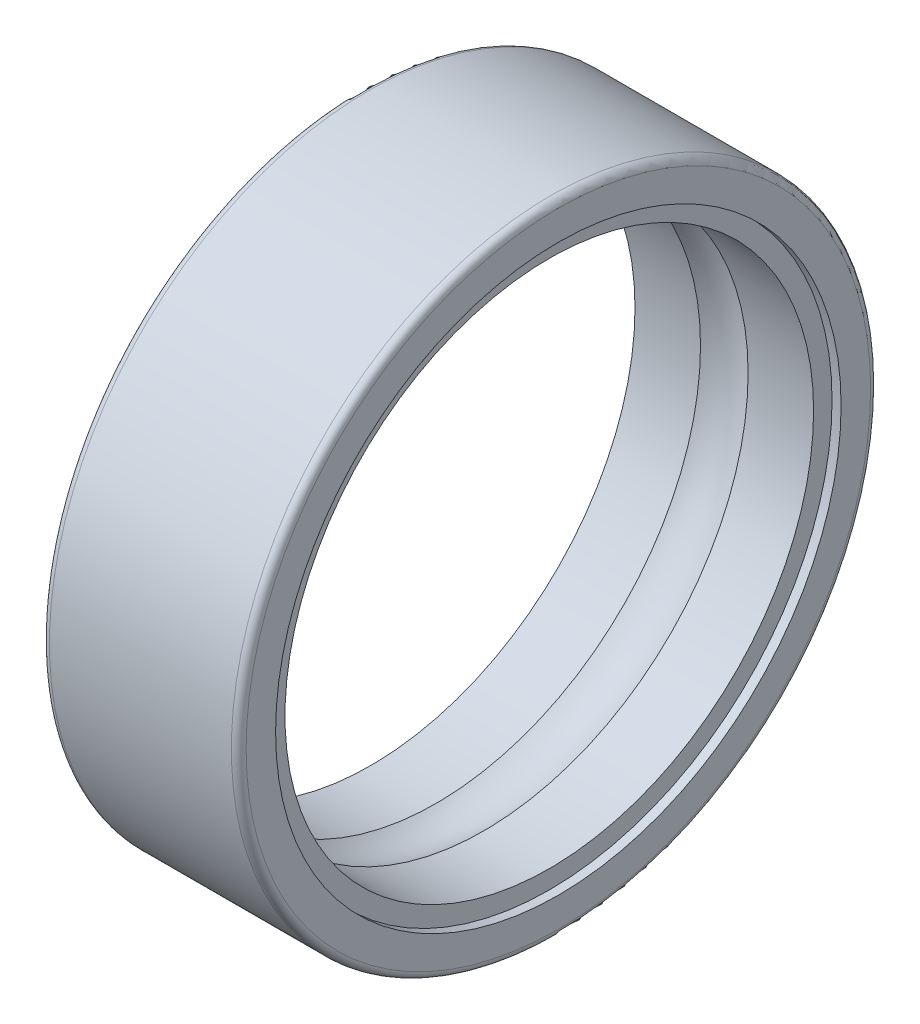
ISO-10303-21;
HEADER;
FILE_DESCRIPTION(('STEP AP214'),'2;1');
FILE_NAME('part.step','',(''),(''),'','','');
FILE_SCHEMA(('AUTOMOTIVE_DESIGN { 1 0 10303 214 1 1 1 1 }'));
ENDSEC;
DATA;
#1=APPLICATION_CONTEXT('core data for automotive mechanical design processes');
#2=APPLICATION_PROTOCOL_DEFINITION('international standard','automotive_design',2000,#1);
#3=PRODUCT_CONTEXT('',#1,'mechanical');
#4=PRODUCT('Part','Part','',(#3));
#5=PRODUCT_RELATED_PRODUCT_CATEGORY('part','',(#4));
#6=PRODUCT_DEFINITION_FORMATION('','',#4);
#7=PRODUCT_DEFINITION_CONTEXT('part definition',#1,'design');
#8=PRODUCT_DEFINITION('design','',#6,#7);
#9=PRODUCT_DEFINITION_SHAPE('','',#8);
#10=(LENGTH_UNIT() NAMED_UNIT(*) SI_UNIT(.MILLI.,.METRE.));
#11=(NAMED_UNIT(*) PLANE_ANGLE_UNIT() SI_UNIT($,.RADIAN.));
#12=(NAMED_UNIT(*) SI_UNIT($,.STERADIAN.) SOLID_ANGLE_UNIT());
#13=UNCERTAINTY_MEASURE_WITH_UNIT(LENGTH_MEASURE(1.E-05),#10,'distance_accuracy_value','');
#14=(GEOMETRIC_REPRESENTATION_CONTEXT(3) GLOBAL_UNCERTAINTY_ASSIGNED_CONTEXT((#13)) GLOBAL_UNIT_ASSIGNED_CONTEXT((#10,
#11,#12)) REPRESENTATION_CONTEXT('',''));
#15=CARTESIAN_POINT('',(0.,0.,0.));
#16=DIRECTION('',(0.,0.,1.));
#17=DIRECTION('',(1.,0.,0.));
#18=AXIS2_PLACEMENT_3D('',#15,#16,#17);
#19=CARTESIAN_POINT('',(4.,0.,0.));
#20=DIRECTION('',(1.,0.,0.));
#21=DIRECTION('',(0.,0.,-1.));
#22=AXIS2_PLACEMENT_3D('',#19,#20,#21);
#23=TOROIDAL_SURFACE('',#22,8.99999999999983,2.00000000000017);
#24=CARTESIAN_POINT('',(3.0317541634481,0.,0.));
#25=DIRECTION('',(1.,0.,0.));
#26=DIRECTION('',(0.,0.,-1.));
#27=AXIS2_PLACEMENT_3D('',#24,#25,#26);
#28=CIRCLE('',#27,10.75);
#29=CARTESIAN_POINT('',(3.0317541634481,0.,-10.75));
#30=VERTEX_POINT('',#29);
#31=EDGE_CURVE('E136',#30,#30,#28,.F.);
#32=ORIENTED_EDGE('',*,*,#31,.T.);
#33=EDGE_LOOP('',(#32));
#34=FACE_BOUND('',#33,.T.);
#35=CARTESIAN_POINT('',(4.9682458365519,0.,0.));
#36=DIRECTION('',(1.,0.,0.));
#37=DIRECTION('',(0.,0.,-1.));
#38=AXIS2_PLACEMENT_3D('',#35,#36,#37);
#39=CIRCLE('',#38,10.75);
#40=CARTESIAN_POINT('',(4.9682458365519,0.,-10.75));
#41=VERTEX_POINT('',#40);
#42=EDGE_CURVE('E139',#41,#41,#39,.T.);
#43=ORIENTED_EDGE('',*,*,#42,.T.);
#44=EDGE_LOOP('',(#43));
#45=FACE_BOUND('',#44,.T.);
#46=ADVANCED_FACE('F14',(#34,#45),#23,.F.);
#47=CARTESIAN_POINT('',(6.30012291827595,0.,0.));
#48=DIRECTION('',(1.,0.,0.));
#49=DIRECTION('',(0.,0.,-1.));
#50=AXIS2_PLACEMENT_3D('',#47,#48,#49);
#51=CYLINDRICAL_SURFACE('',#50,10.75);
#52=ORIENTED_EDGE('',*,*,#42,.F.);
#53=EDGE_LOOP('',(#52));
#54=FACE_BOUND('',#53,.T.);
#55=CARTESIAN_POINT('',(7.632,0.,0.));
#56=DIRECTION('',(1.,0.,0.));
#57=DIRECTION('',(0.,0.,-1.));
#58=AXIS2_PLACEMENT_3D('',#55,#56,#57);
#59=CIRCLE('',#58,10.75);
#60=CARTESIAN_POINT('',(7.632,0.,-10.75));
#61=VERTEX_POINT('',#60);
#62=EDGE_CURVE('E18',#61,#61,#59,.F.);
#63=ORIENTED_EDGE('',*,*,#62,.F.);
#64=EDGE_LOOP('',(#63));
#65=FACE_BOUND('',#64,.T.);
#66=ADVANCED_FACE('F97',(#54,#65),#51,.F.);
#67=CARTESIAN_POINT('',(1.69987708172405,0.,0.));
#68=DIRECTION('',(1.,0.,0.));
#69=DIRECTION('',(0.,0.,-1.));
#70=AXIS2_PLACEMENT_3D('',#67,#68,#69);
#71=CYLINDRICAL_SURFACE('',#70,10.75);
#72=CARTESIAN_POINT('',(0.368,0.,0.));
#73=DIRECTION('',(1.,0.,0.));
#74=DIRECTION('',(0.,0.,-1.));
#75=AXIS2_PLACEMENT_3D('',#72,#73,#74);
#76=CIRCLE('',#75,10.75);
#77=CARTESIAN_POINT('',(0.368,0.,-10.75));
#78=VERTEX_POINT('',#77);
#79=EDGE_CURVE('E132',#78,#78,#76,.T.);
#80=ORIENTED_EDGE('',*,*,#79,.F.);
#81=EDGE_LOOP('',(#80));
#82=FACE_BOUND('',#81,.T.);
#83=ORIENTED_EDGE('',*,*,#31,.F.);
#84=EDGE_LOOP('',(#83));
#85=FACE_BOUND('',#84,.T.);
#86=ADVANCED_FACE('F94',(#82,#85),#71,.F.);
#87=CARTESIAN_POINT('',(7.632,10.75,0.));
#88=DIRECTION('',(1.,0.,0.));
#89=DIRECTION('',(0.,0.,-1.));
#90=AXIS2_PLACEMENT_3D('',#87,#88,#89);
#91=PLANE('',#90);
#92=ORIENTED_EDGE('',*,*,#62,.T.);
#93=EDGE_LOOP('',(#92));
#94=FACE_BOUND('',#93,.T.);
#95=CARTESIAN_POINT('',(7.632,0.,0.));
#96=DIRECTION('',(1.,0.,0.));
#97=DIRECTION('',(0.,0.,-1.));
#98=AXIS2_PLACEMENT_3D('',#95,#96,#97);
#99=CIRCLE('',#98,11.5);
#100=CARTESIAN_POINT('',(7.632,0.,-11.5));
#101=VERTEX_POINT('',#100);
#102=EDGE_CURVE('E130',#101,#101,#99,.T.);
#103=ORIENTED_EDGE('',*,*,#102,.T.);
#104=EDGE_LOOP('',(#103));
#105=FACE_BOUND('',#104,.T.);
#106=ADVANCED_FACE('F90',(#94,#105),#91,.T.);
#107=CARTESIAN_POINT('',(0.368,11.5,0.));
#108=DIRECTION('',(-1.,0.,0.));
#109=DIRECTION('',(0.,0.,1.));
#110=AXIS2_PLACEMENT_3D('',#107,#108,#109);
#111=PLANE('',#110);
#112=ORIENTED_EDGE('',*,*,#79,.T.);
#113=EDGE_LOOP('',(#112));
#114=FACE_BOUND('',#113,.T.);
#115=CARTESIAN_POINT('',(0.368,0.,0.));
#116=DIRECTION('',(1.,0.,0.));
#117=DIRECTION('',(0.,0.,-1.));
#118=AXIS2_PLACEMENT_3D('',#115,#116,#117);
#119=CIRCLE('',#118,11.5);
#120=CARTESIAN_POINT('',(0.368,0.,-11.5));
#121=VERTEX_POINT('',#120);
#122=EDGE_CURVE('E123',#121,#121,#119,.F.);
#123=ORIENTED_EDGE('',*,*,#122,.T.);
#124=EDGE_LOOP('',(#123));
#125=FACE_BOUND('',#124,.T.);
#126=ADVANCED_FACE('F86',(#114,#125),#111,.T.);
#127=CARTESIAN_POINT('',(7.816,0.,0.));
#128=DIRECTION('',(1.,0.,0.));
#129=DIRECTION('',(0.,0.,-1.));
#130=AXIS2_PLACEMENT_3D('',#127,#128,#129);
#131=CYLINDRICAL_SURFACE('',#130,11.5);
#132=ORIENTED_EDGE('',*,*,#102,.F.);
#133=EDGE_LOOP('',(#132));
#134=FACE_BOUND('',#133,.T.);
#135=CARTESIAN_POINT('',(8.,0.,0.));
#136=DIRECTION('',(1.,0.,0.));
#137=DIRECTION('',(0.,0.,-1.));
#138=AXIS2_PLACEMENT_3D('',#135,#136,#137);
#139=CIRCLE('',#138,11.5);
#140=CARTESIAN_POINT('',(8.,0.,-11.5));
#141=VERTEX_POINT('',#140);
#142=EDGE_CURVE('E118',#141,#141,#139,.F.);
#143=ORIENTED_EDGE('',*,*,#142,.F.);
#144=EDGE_LOOP('',(#143));
#145=FACE_BOUND('',#144,.T.);
#146=ADVANCED_FACE('F82',(#134,#145),#131,.F.);
#147=CARTESIAN_POINT('',(0.184,0.,0.));
#148=DIRECTION('',(1.,0.,0.));
#149=DIRECTION('',(0.,0.,-1.));
#150=AXIS2_PLACEMENT_3D('',#147,#148,#149);
#151=CYLINDRICAL_SURFACE('',#150,11.5);
#152=CARTESIAN_POINT('',(0.,0.,0.));
#153=DIRECTION('',(1.,0.,0.));
#154=DIRECTION('',(0.,0.,-1.));
#155=AXIS2_PLACEMENT_3D('',#152,#153,#154);
#156=CIRCLE('',#155,11.5);
#157=CARTESIAN_POINT('',(0.,0.,-11.5));
#158=VERTEX_POINT('',#157);
#159=EDGE_CURVE('E116',#158,#158,#156,.T.);
#160=ORIENTED_EDGE('',*,*,#159,.F.);
#161=EDGE_LOOP('',(#160));
#162=FACE_BOUND('',#161,.T.);
#163=ORIENTED_EDGE('',*,*,#122,.F.);
#164=EDGE_LOOP('',(#163));
#165=FACE_BOUND('',#164,.T.);
#166=ADVANCED_FACE('F77',(#162,#165),#151,.F.);
#167=CARTESIAN_POINT('',(8.,11.5,0.));
#168=DIRECTION('',(1.,0.,0.));
#169=DIRECTION('',(0.,0.,-1.));
#170=AXIS2_PLACEMENT_3D('',#167,#168,#169);
#171=PLANE('',#170);
#172=ORIENTED_EDGE('',*,*,#142,.T.);
#173=EDGE_LOOP('',(#172));
#174=FACE_BOUND('',#173,.T.);
#175=CARTESIAN_POINT('',(8.,0.,0.));
#176=DIRECTION('',(-1.,0.,0.));
#177=DIRECTION('',(0.,0.,1.));
#178=AXIS2_PLACEMENT_3D('',#175,#176,#177);
#179=CIRCLE('',#178,12.7);
#180=CARTESIAN_POINT('',(8.,0.,12.7));
#181=VERTEX_POINT('',#180);
#182=EDGE_CURVE('E61',#181,#181,#179,.T.);
#183=ORIENTED_EDGE('',*,*,#182,.F.);
#184=EDGE_LOOP('',(#183));
#185=FACE_BOUND('',#184,.T.);
#186=ADVANCED_FACE('F67',(#174,#185),#171,.T.);
#187=CARTESIAN_POINT('',(0.,12.7,0.));
#188=DIRECTION('',(-1.,0.,0.));
#189=DIRECTION('',(0.,0.,1.));
#190=AXIS2_PLACEMENT_3D('',#187,#188,#189);
#191=PLANE('',#190);
#192=ORIENTED_EDGE('',*,*,#159,.T.);
#193=EDGE_LOOP('',(#192));
#194=FACE_BOUND('',#193,.T.);
#195=CARTESIAN_POINT('',(0.,0.,0.));
#196=DIRECTION('',(1.,0.,0.));
#197=DIRECTION('',(0.,0.,1.));
#198=AXIS2_PLACEMENT_3D('',#195,#196,#197);
#199=CIRCLE('',#198,12.7);
#200=CARTESIAN_POINT('',(0.,0.,12.7));
#201=VERTEX_POINT('',#200);
#202=EDGE_CURVE('E27',#201,#201,#199,.T.);
#203=ORIENTED_EDGE('',*,*,#202,.F.);
#204=EDGE_LOOP('',(#203));
#205=FACE_BOUND('',#204,.T.);
#206=ADVANCED_FACE('F76',(#194,#205),#191,.T.);
#207=CARTESIAN_POINT('',(7.70000000000012,0.,0.));
#208=DIRECTION('',(1.,0.,0.));
#209=DIRECTION('',(0.,0.,-1.));
#210=AXIS2_PLACEMENT_3D('',#207,#208,#209);
#211=TOROIDAL_SURFACE('',#210,12.7000000000001,0.299999999999876);
#212=CARTESIAN_POINT('',(7.7,0.,0.));
#213=DIRECTION('',(1.,0.,0.));
#214=DIRECTION('',(0.,0.,-1.));
#215=AXIS2_PLACEMENT_3D('',#212,#213,#214);
#216=CIRCLE('',#215,13.);
#217=CARTESIAN_POINT('',(7.7,0.,-13.));
#218=VERTEX_POINT('',#217);
#219=EDGE_CURVE('E22',#218,#218,#216,.F.);
#220=ORIENTED_EDGE('',*,*,#219,.F.);
#221=EDGE_LOOP('',(#220));
#222=FACE_BOUND('',#221,.T.);
#223=ORIENTED_EDGE('',*,*,#182,.T.);
#224=EDGE_LOOP('',(#223));
#225=FACE_BOUND('',#224,.T.);
#226=ADVANCED_FACE('F41',(#222,#225),#211,.T.);
#227=CARTESIAN_POINT('',(0.299999999999938,0.,0.));
#228=DIRECTION('',(1.,0.,0.));
#229=DIRECTION('',(0.,0.,-1.));
#230=AXIS2_PLACEMENT_3D('',#227,#228,#229);
#231=TOROIDAL_SURFACE('',#230,12.7000000000001,0.299999999999938);
#232=ORIENTED_EDGE('',*,*,#202,.T.);
#233=EDGE_LOOP('',(#232));
#234=FACE_BOUND('',#233,.T.);
#235=CARTESIAN_POINT('',(0.3,0.,0.));
#236=DIRECTION('',(1.,0.,0.));
#237=DIRECTION('',(0.,0.,-1.));
#238=AXIS2_PLACEMENT_3D('',#235,#236,#237);
#239=CIRCLE('',#238,13.);
#240=CARTESIAN_POINT('',(0.3,0.,-13.));
#241=VERTEX_POINT('',#240);
#242=EDGE_CURVE('E10',#241,#241,#239,.T.);
#243=ORIENTED_EDGE('',*,*,#242,.F.);
#244=EDGE_LOOP('',(#243));
#245=FACE_BOUND('',#244,.T.);
#246=ADVANCED_FACE('F35',(#234,#245),#231,.T.);
#247=CARTESIAN_POINT('',(4.,0.,0.));
#248=DIRECTION('',(1.,0.,0.));
#249=DIRECTION('',(0.,0.,-1.));
#250=AXIS2_PLACEMENT_3D('',#247,#248,#249);
#251=CYLINDRICAL_SURFACE('',#250,13.);
#252=ORIENTED_EDGE('',*,*,#242,.T.);
#253=EDGE_LOOP('',(#252));
#254=FACE_BOUND('',#253,.T.);
#255=ORIENTED_EDGE('',*,*,#219,.T.);
#256=EDGE_LOOP('',(#255));
#257=FACE_BOUND('',#256,.T.);
#258=ADVANCED_FACE('F40',(#254,#257),#251,.T.);
#259=CLOSED_SHELL('',(#46,#66,#86,#106,#126,#146,#166,#186,#206,#226,#246,#258));
#260=MANIFOLD_SOLID_BREP('B1',#259);
#261=ADVANCED_BREP_SHAPE_REPRESENTATION('',(#18,#260),#14);
#262=SHAPE_DEFINITION_REPRESENTATION(#9,#261);
ENDSEC;
END-ISO-10303-21;
